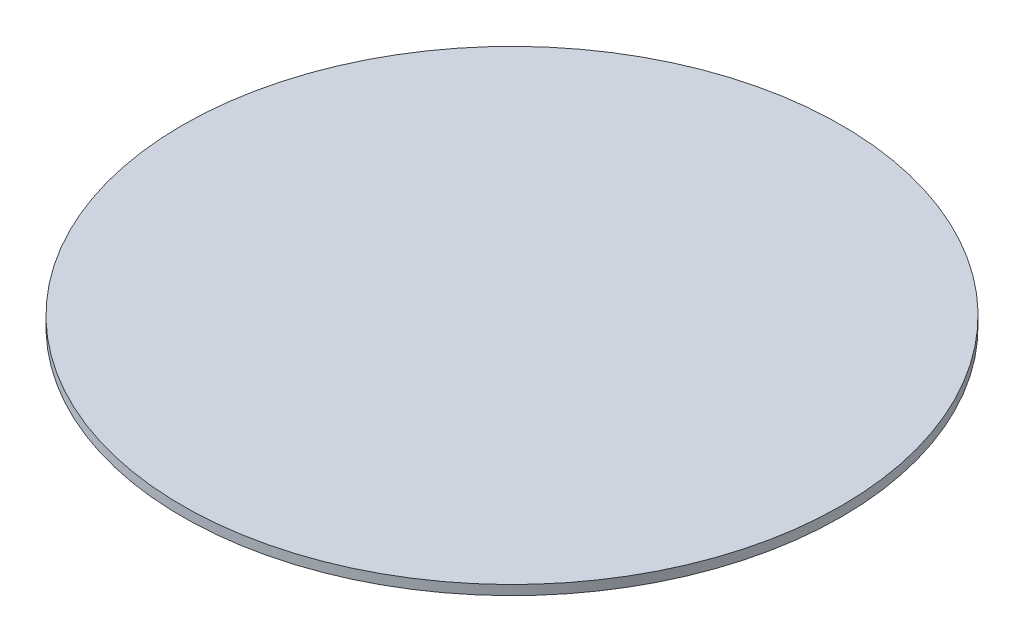
ISO-10303-21;
HEADER;
FILE_DESCRIPTION(('STEP AP214'),'2;1');
FILE_NAME('part.step','',(''),(''),'','','');
FILE_SCHEMA(('AUTOMOTIVE_DESIGN { 1 0 10303 214 1 1 1 1 }'));
ENDSEC;
DATA;
#1=APPLICATION_CONTEXT('core data for automotive mechanical design processes');
#2=APPLICATION_PROTOCOL_DEFINITION('international standard','automotive_design',2000,#1);
#3=PRODUCT_CONTEXT('',#1,'mechanical');
#4=PRODUCT('Part','Part','',(#3));
#5=PRODUCT_RELATED_PRODUCT_CATEGORY('part','',(#4));
#6=PRODUCT_DEFINITION_FORMATION('','',#4);
#7=PRODUCT_DEFINITION_CONTEXT('part definition',#1,'design');
#8=PRODUCT_DEFINITION('design','',#6,#7);
#9=PRODUCT_DEFINITION_SHAPE('','',#8);
#10=(LENGTH_UNIT() NAMED_UNIT(*) SI_UNIT(.MILLI.,.METRE.));
#11=(NAMED_UNIT(*) PLANE_ANGLE_UNIT() SI_UNIT($,.RADIAN.));
#12=(NAMED_UNIT(*) SI_UNIT($,.STERADIAN.) SOLID_ANGLE_UNIT());
#13=UNCERTAINTY_MEASURE_WITH_UNIT(LENGTH_MEASURE(1.E-05),#10,'distance_accuracy_value','');
#14=(GEOMETRIC_REPRESENTATION_CONTEXT(3) GLOBAL_UNCERTAINTY_ASSIGNED_CONTEXT((#13)) GLOBAL_UNIT_ASSIGNED_CONTEXT((#10,
#11,#12)) REPRESENTATION_CONTEXT('',''));
#15=CARTESIAN_POINT('',(0.,0.,0.));
#16=DIRECTION('',(0.,0.,1.));
#17=DIRECTION('',(1.,0.,0.));
#18=AXIS2_PLACEMENT_3D('',#15,#16,#17);
#19=CARTESIAN_POINT('',(0.,-1.2,0.));
#20=DIRECTION('',(0.,1.,0.));
#21=DIRECTION('',(0.,0.,1.));
#22=AXIS2_PLACEMENT_3D('',#19,#20,#21);
#23=CYLINDRICAL_SURFACE('',#22,41.);
#24=CARTESIAN_POINT('',(0.,-1.2,0.));
#25=DIRECTION('',(0.,1.,0.));
#26=DIRECTION('',(1.,0.,0.));
#27=AXIS2_PLACEMENT_3D('',#24,#25,#26);
#28=CIRCLE('',#27,41.);
#29=CARTESIAN_POINT('',(41.,-1.2,0.));
#30=VERTEX_POINT('',#29);
#31=EDGE_CURVE('E10',#30,#30,#28,.T.);
#32=ORIENTED_EDGE('',*,*,#31,.T.);
#33=EDGE_LOOP('',(#32));
#34=FACE_BOUND('',#33,.T.);
#35=CARTESIAN_POINT('',(0.,0.,0.));
#36=DIRECTION('',(0.,1.,0.));
#37=DIRECTION('',(1.,0.,0.));
#38=AXIS2_PLACEMENT_3D('',#35,#36,#37);
#39=CIRCLE('',#38,41.);
#40=CARTESIAN_POINT('',(41.,0.,0.));
#41=VERTEX_POINT('',#40);
#42=EDGE_CURVE('E19',#41,#41,#39,.T.);
#43=ORIENTED_EDGE('',*,*,#42,.F.);
#44=EDGE_LOOP('',(#43));
#45=FACE_BOUND('',#44,.T.);
#46=ADVANCED_FACE('F16',(#34,#45),#23,.T.);
#47=CARTESIAN_POINT('',(0.,-1.2,0.));
#48=DIRECTION('',(0.,1.,0.));
#49=DIRECTION('',(0.,0.,1.));
#50=AXIS2_PLACEMENT_3D('',#47,#48,#49);
#51=PLANE('',#50);
#52=ORIENTED_EDGE('',*,*,#31,.F.);
#53=EDGE_LOOP('',(#52));
#54=FACE_BOUND('',#53,.T.);
#55=ADVANCED_FACE('F34',(#54),#51,.F.);
#56=CARTESIAN_POINT('',(0.,0.,0.));
#57=DIRECTION('',(0.,1.,0.));
#58=DIRECTION('',(0.,0.,1.));
#59=AXIS2_PLACEMENT_3D('',#56,#57,#58);
#60=PLANE('',#59);
#61=ORIENTED_EDGE('',*,*,#42,.T.);
#62=EDGE_LOOP('',(#61));
#63=FACE_BOUND('',#62,.T.);
#64=ADVANCED_FACE('F31',(#63),#60,.T.);
#65=CLOSED_SHELL('',(#46,#55,#64));
#66=MANIFOLD_SOLID_BREP('B1',#65);
#67=ADVANCED_BREP_SHAPE_REPRESENTATION('',(#18,#66),#14);
#68=SHAPE_DEFINITION_REPRESENTATION(#9,#67);
ENDSEC;
END-ISO-10303-21;
